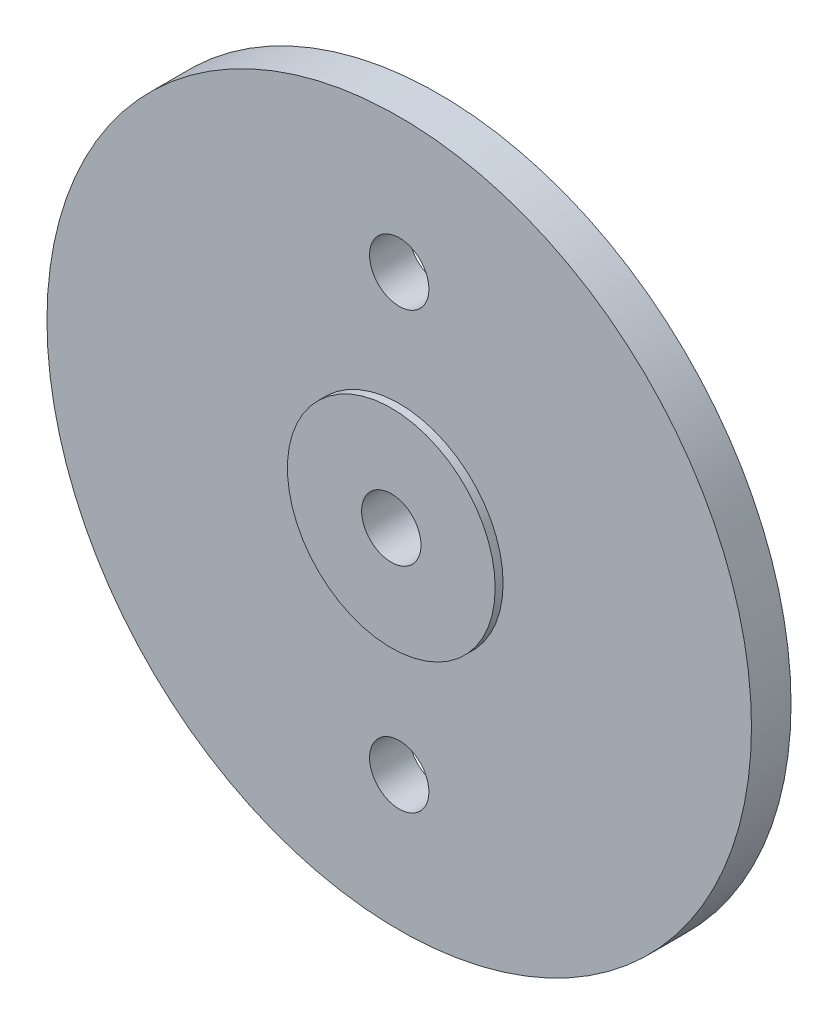
ISO-10303-21;
HEADER;
FILE_DESCRIPTION(('STEP AP214'),'2;1');
FILE_NAME('part.step','',(''),(''),'','','');
FILE_SCHEMA(('AUTOMOTIVE_DESIGN { 1 0 10303 214 1 1 1 1 }'));
ENDSEC;
DATA;
#1=APPLICATION_CONTEXT('core data for automotive mechanical design processes');
#2=APPLICATION_PROTOCOL_DEFINITION('international standard','automotive_design',2000,#1);
#3=PRODUCT_CONTEXT('',#1,'mechanical');
#4=PRODUCT('Part','Part','',(#3));
#5=PRODUCT_RELATED_PRODUCT_CATEGORY('part','',(#4));
#6=PRODUCT_DEFINITION_FORMATION('','',#4);
#7=PRODUCT_DEFINITION_CONTEXT('part definition',#1,'design');
#8=PRODUCT_DEFINITION('design','',#6,#7);
#9=PRODUCT_DEFINITION_SHAPE('','',#8);
#10=(LENGTH_UNIT() NAMED_UNIT(*) SI_UNIT(.MILLI.,.METRE.));
#11=(NAMED_UNIT(*) PLANE_ANGLE_UNIT() SI_UNIT($,.RADIAN.));
#12=(NAMED_UNIT(*) SI_UNIT($,.STERADIAN.) SOLID_ANGLE_UNIT());
#13=UNCERTAINTY_MEASURE_WITH_UNIT(LENGTH_MEASURE(1.E-05),#10,'distance_accuracy_value','');
#14=(GEOMETRIC_REPRESENTATION_CONTEXT(3) GLOBAL_UNCERTAINTY_ASSIGNED_CONTEXT((#13)) GLOBAL_UNIT_ASSIGNED_CONTEXT((#10,
#11,#12)) REPRESENTATION_CONTEXT('',''));
#15=CARTESIAN_POINT('',(0.,0.,0.));
#16=DIRECTION('',(0.,0.,1.));
#17=DIRECTION('',(1.,0.,0.));
#18=AXIS2_PLACEMENT_3D('',#15,#16,#17);
#19=CARTESIAN_POINT('',(0.,0.,2.));
#20=DIRECTION('',(0.,0.,-1.));
#21=DIRECTION('',(-1.,0.,0.));
#22=AXIS2_PLACEMENT_3D('',#19,#20,#21);
#23=CYLINDRICAL_SURFACE('',#22,17.8);
#24=CARTESIAN_POINT('',(0.,0.,2.));
#25=DIRECTION('',(0.,0.,1.));
#26=DIRECTION('',(1.,0.,0.));
#27=AXIS2_PLACEMENT_3D('',#24,#25,#26);
#28=CIRCLE('',#27,17.8);
#29=CARTESIAN_POINT('',(17.8,0.,2.));
#30=VERTEX_POINT('',#29);
#31=EDGE_CURVE('E57',#30,#30,#28,.T.);
#32=ORIENTED_EDGE('',*,*,#31,.F.);
#33=EDGE_LOOP('',(#32));
#34=FACE_BOUND('',#33,.T.);
#35=CARTESIAN_POINT('',(0.,0.,0.));
#36=DIRECTION('',(0.,0.,1.));
#37=DIRECTION('',(1.,0.,0.));
#38=AXIS2_PLACEMENT_3D('',#35,#36,#37);
#39=CIRCLE('',#38,17.8);
#40=CARTESIAN_POINT('',(17.8,0.,0.));
#41=VERTEX_POINT('',#40);
#42=EDGE_CURVE('E56',#41,#41,#39,.T.);
#43=ORIENTED_EDGE('',*,*,#42,.T.);
#44=EDGE_LOOP('',(#43));
#45=FACE_BOUND('',#44,.T.);
#46=ADVANCED_FACE('F31',(#34,#45),#23,.T.);
#47=CARTESIAN_POINT('',(0.,0.,2.));
#48=DIRECTION('',(0.,0.,1.));
#49=DIRECTION('',(1.,0.,0.));
#50=AXIS2_PLACEMENT_3D('',#47,#48,#49);
#51=PLANE('',#50);
#52=CARTESIAN_POINT('',(0.,11.,2.));
#53=DIRECTION('',(0.,0.,1.));
#54=DIRECTION('',(1.,0.,0.));
#55=AXIS2_PLACEMENT_3D('',#52,#53,#54);
#56=CIRCLE('',#55,1.5);
#57=CARTESIAN_POINT('',(1.5,11.,2.));
#58=VERTEX_POINT('',#57);
#59=EDGE_CURVE('E65',#58,#58,#56,.T.);
#60=ORIENTED_EDGE('',*,*,#59,.F.);
#61=EDGE_LOOP('',(#60));
#62=FACE_BOUND('',#61,.T.);
#63=CARTESIAN_POINT('',(0.,-11.,2.));
#64=DIRECTION('',(0.,0.,1.));
#65=DIRECTION('',(1.,0.,0.));
#66=AXIS2_PLACEMENT_3D('',#63,#64,#65);
#67=CIRCLE('',#66,1.5);
#68=CARTESIAN_POINT('',(1.5,-11.,2.));
#69=VERTEX_POINT('',#68);
#70=EDGE_CURVE('E71',#69,#69,#67,.T.);
#71=ORIENTED_EDGE('',*,*,#70,.F.);
#72=EDGE_LOOP('',(#71));
#73=FACE_BOUND('',#72,.T.);
#74=CARTESIAN_POINT('',(0.,0.,2.));
#75=DIRECTION('',(0.,0.,1.));
#76=DIRECTION('',(1.,0.,0.));
#77=AXIS2_PLACEMENT_3D('',#74,#75,#76);
#78=CIRCLE('',#77,5.25);
#79=CARTESIAN_POINT('',(5.25,0.,2.));
#80=VERTEX_POINT('',#79);
#81=EDGE_CURVE('E10',#80,#80,#78,.T.);
#82=ORIENTED_EDGE('',*,*,#81,.F.);
#83=EDGE_LOOP('',(#82));
#84=FACE_BOUND('',#83,.T.);
#85=ORIENTED_EDGE('',*,*,#31,.T.);
#86=EDGE_LOOP('',(#85));
#87=FACE_BOUND('',#86,.T.);
#88=ADVANCED_FACE('F103',(#62,#73,#84,#87),#51,.T.);
#89=CARTESIAN_POINT('',(0.,0.,0.));
#90=DIRECTION('',(0.,0.,1.));
#91=DIRECTION('',(1.,0.,0.));
#92=AXIS2_PLACEMENT_3D('',#89,#90,#91);
#93=PLANE('',#92);
#94=CARTESIAN_POINT('',(0.,11.,0.));
#95=DIRECTION('',(0.,0.,1.));
#96=DIRECTION('',(1.,0.,0.));
#97=AXIS2_PLACEMENT_3D('',#94,#95,#96);
#98=CIRCLE('',#97,1.5);
#99=CARTESIAN_POINT('',(1.5,11.,0.));
#100=VERTEX_POINT('',#99);
#101=EDGE_CURVE('E35',#100,#100,#98,.T.);
#102=ORIENTED_EDGE('',*,*,#101,.T.);
#103=EDGE_LOOP('',(#102));
#104=FACE_BOUND('',#103,.T.);
#105=CARTESIAN_POINT('',(0.,-11.,0.));
#106=DIRECTION('',(0.,0.,1.));
#107=DIRECTION('',(1.,0.,0.));
#108=AXIS2_PLACEMENT_3D('',#105,#106,#107);
#109=CIRCLE('',#108,1.5);
#110=CARTESIAN_POINT('',(1.5,-11.,0.));
#111=VERTEX_POINT('',#110);
#112=EDGE_CURVE('E63',#111,#111,#109,.T.);
#113=ORIENTED_EDGE('',*,*,#112,.T.);
#114=EDGE_LOOP('',(#113));
#115=FACE_BOUND('',#114,.T.);
#116=CARTESIAN_POINT('',(0.,0.,0.));
#117=DIRECTION('',(0.,0.,1.));
#118=DIRECTION('',(1.,0.,0.));
#119=AXIS2_PLACEMENT_3D('',#116,#117,#118);
#120=CIRCLE('',#119,7.86396405194257);
#121=CARTESIAN_POINT('',(7.86396405194257,0.,0.));
#122=VERTEX_POINT('',#121);
#123=EDGE_CURVE('E44',#122,#122,#120,.F.);
#124=ORIENTED_EDGE('',*,*,#123,.F.);
#125=EDGE_LOOP('',(#124));
#126=FACE_BOUND('',#125,.T.);
#127=ORIENTED_EDGE('',*,*,#42,.F.);
#128=EDGE_LOOP('',(#127));
#129=FACE_BOUND('',#128,.T.);
#130=ADVANCED_FACE('F108',(#104,#115,#126,#129),#93,.F.);
#131=CARTESIAN_POINT('',(0.,0.,-0.8));
#132=DIRECTION('',(0.,0.,1.));
#133=DIRECTION('',(-1.,0.,0.));
#134=AXIS2_PLACEMENT_3D('',#131,#132,#133);
#135=CONICAL_SURFACE('',#134,7.85,0.0174532925199433);
#136=CARTESIAN_POINT('',(0.,0.,-0.8));
#137=DIRECTION('',(0.,0.,-1.));
#138=DIRECTION('',(-1.,0.,0.));
#139=AXIS2_PLACEMENT_3D('',#136,#137,#138);
#140=CIRCLE('',#139,7.85);
#141=CARTESIAN_POINT('',(-7.85,0.,-0.8));
#142=VERTEX_POINT('',#141);
#143=EDGE_CURVE('E52',#142,#142,#140,.T.);
#144=ORIENTED_EDGE('',*,*,#143,.F.);
#145=EDGE_LOOP('',(#144));
#146=FACE_BOUND('',#145,.T.);
#147=ORIENTED_EDGE('',*,*,#123,.T.);
#148=EDGE_LOOP('',(#147));
#149=FACE_BOUND('',#148,.T.);
#150=ADVANCED_FACE('F33',(#146,#149),#135,.T.);
#151=CARTESIAN_POINT('',(0.,0.,-0.8));
#152=DIRECTION('',(0.,0.,-1.));
#153=DIRECTION('',(-1.,0.,0.));
#154=AXIS2_PLACEMENT_3D('',#151,#152,#153);
#155=PLANE('',#154);
#156=CARTESIAN_POINT('',(0.,0.,-0.8));
#157=DIRECTION('',(0.,0.,-1.));
#158=DIRECTION('',(-1.,0.,0.));
#159=AXIS2_PLACEMENT_3D('',#156,#157,#158);
#160=CIRCLE('',#159,4.8);
#161=CARTESIAN_POINT('',(-4.8,0.,-0.8));
#162=VERTEX_POINT('',#161);
#163=EDGE_CURVE('E39',#162,#162,#160,.T.);
#164=ORIENTED_EDGE('',*,*,#163,.F.);
#165=EDGE_LOOP('',(#164));
#166=FACE_BOUND('',#165,.T.);
#167=ORIENTED_EDGE('',*,*,#143,.T.);
#168=EDGE_LOOP('',(#167));
#169=FACE_BOUND('',#168,.T.);
#170=ADVANCED_FACE('F117',(#166,#169),#155,.T.);
#171=CARTESIAN_POINT('',(0.,0.,-2.7));
#172=DIRECTION('',(0.,0.,1.));
#173=DIRECTION('',(1.,0.,0.));
#174=AXIS2_PLACEMENT_3D('',#171,#172,#173);
#175=CYLINDRICAL_SURFACE('',#174,4.8);
#176=CARTESIAN_POINT('',(0.,0.,-2.7));
#177=DIRECTION('',(0.,0.,-1.));
#178=DIRECTION('',(-1.,0.,0.));
#179=AXIS2_PLACEMENT_3D('',#176,#177,#178);
#180=CIRCLE('',#179,4.8);
#181=CARTESIAN_POINT('',(-4.8,0.,-2.7));
#182=VERTEX_POINT('',#181);
#183=EDGE_CURVE('E50',#182,#182,#180,.T.);
#184=ORIENTED_EDGE('',*,*,#183,.F.);
#185=EDGE_LOOP('',(#184));
#186=FACE_BOUND('',#185,.T.);
#187=ORIENTED_EDGE('',*,*,#163,.T.);
#188=EDGE_LOOP('',(#187));
#189=FACE_BOUND('',#188,.T.);
#190=ADVANCED_FACE('F99',(#186,#189),#175,.T.);
#191=CARTESIAN_POINT('',(0.,0.,-2.7));
#192=DIRECTION('',(0.,0.,-1.));
#193=DIRECTION('',(-1.,0.,0.));
#194=AXIS2_PLACEMENT_3D('',#191,#192,#193);
#195=PLANE('',#194);
#196=CARTESIAN_POINT('',(0.,0.,-2.7));
#197=DIRECTION('',(0.,0.,-1.));
#198=DIRECTION('',(-1.,0.,0.));
#199=AXIS2_PLACEMENT_3D('',#196,#197,#198);
#200=CIRCLE('',#199,1.5);
#201=CARTESIAN_POINT('',(-1.5,0.,-2.7));
#202=VERTEX_POINT('',#201);
#203=EDGE_CURVE('E79',#202,#202,#200,.T.);
#204=ORIENTED_EDGE('',*,*,#203,.F.);
#205=EDGE_LOOP('',(#204));
#206=FACE_BOUND('',#205,.T.);
#207=ORIENTED_EDGE('',*,*,#183,.T.);
#208=EDGE_LOOP('',(#207));
#209=FACE_BOUND('',#208,.T.);
#210=ADVANCED_FACE('F90',(#206,#209),#195,.T.);
#211=CARTESIAN_POINT('',(0.,0.,2.4));
#212=DIRECTION('',(0.,0.,-1.));
#213=DIRECTION('',(-1.,0.,0.));
#214=AXIS2_PLACEMENT_3D('',#211,#212,#213);
#215=CYLINDRICAL_SURFACE('',#214,5.25);
#216=CARTESIAN_POINT('',(0.,0.,2.4));
#217=DIRECTION('',(0.,0.,1.));
#218=DIRECTION('',(1.,0.,0.));
#219=AXIS2_PLACEMENT_3D('',#216,#217,#218);
#220=CIRCLE('',#219,5.25);
#221=CARTESIAN_POINT('',(5.25,0.,2.4));
#222=VERTEX_POINT('',#221);
#223=EDGE_CURVE('E48',#222,#222,#220,.T.);
#224=ORIENTED_EDGE('',*,*,#223,.F.);
#225=EDGE_LOOP('',(#224));
#226=FACE_BOUND('',#225,.T.);
#227=ORIENTED_EDGE('',*,*,#81,.T.);
#228=EDGE_LOOP('',(#227));
#229=FACE_BOUND('',#228,.T.);
#230=ADVANCED_FACE('F88',(#226,#229),#215,.T.);
#231=CARTESIAN_POINT('',(0.,0.,2.4));
#232=DIRECTION('',(0.,0.,1.));
#233=DIRECTION('',(1.,0.,0.));
#234=AXIS2_PLACEMENT_3D('',#231,#232,#233);
#235=PLANE('',#234);
#236=CARTESIAN_POINT('',(0.,0.,2.4));
#237=DIRECTION('',(0.,0.,1.));
#238=DIRECTION('',(1.,0.,0.));
#239=AXIS2_PLACEMENT_3D('',#236,#237,#238);
#240=CIRCLE('',#239,1.5);
#241=CARTESIAN_POINT('',(1.5,0.,2.4));
#242=VERTEX_POINT('',#241);
#243=EDGE_CURVE('E69',#242,#242,#240,.T.);
#244=ORIENTED_EDGE('',*,*,#243,.F.);
#245=EDGE_LOOP('',(#244));
#246=FACE_BOUND('',#245,.T.);
#247=ORIENTED_EDGE('',*,*,#223,.T.);
#248=EDGE_LOOP('',(#247));
#249=FACE_BOUND('',#248,.T.);
#250=ADVANCED_FACE('F86',(#246,#249),#235,.T.);
#251=CARTESIAN_POINT('',(0.,0.,-8.));
#252=DIRECTION('',(0.,0.,1.));
#253=DIRECTION('',(1.,0.,0.));
#254=AXIS2_PLACEMENT_3D('',#251,#252,#253);
#255=CYLINDRICAL_SURFACE('',#254,1.5);
#256=ORIENTED_EDGE('',*,*,#203,.T.);
#257=EDGE_LOOP('',(#256));
#258=FACE_BOUND('',#257,.T.);
#259=ORIENTED_EDGE('',*,*,#243,.T.);
#260=EDGE_LOOP('',(#259));
#261=FACE_BOUND('',#260,.T.);
#262=ADVANCED_FACE('F96',(#258,#261),#255,.F.);
#263=CARTESIAN_POINT('',(0.,-11.,-8.));
#264=DIRECTION('',(0.,0.,1.));
#265=DIRECTION('',(1.,0.,0.));
#266=AXIS2_PLACEMENT_3D('',#263,#264,#265);
#267=CYLINDRICAL_SURFACE('',#266,1.5);
#268=ORIENTED_EDGE('',*,*,#70,.T.);
#269=EDGE_LOOP('',(#268));
#270=FACE_BOUND('',#269,.T.);
#271=ORIENTED_EDGE('',*,*,#112,.F.);
#272=EDGE_LOOP('',(#271));
#273=FACE_BOUND('',#272,.T.);
#274=ADVANCED_FACE('F174',(#270,#273),#267,.F.);
#275=CARTESIAN_POINT('',(0.,11.,-8.));
#276=DIRECTION('',(0.,0.,1.));
#277=DIRECTION('',(1.,0.,0.));
#278=AXIS2_PLACEMENT_3D('',#275,#276,#277);
#279=CYLINDRICAL_SURFACE('',#278,1.5);
#280=ORIENTED_EDGE('',*,*,#59,.T.);
#281=EDGE_LOOP('',(#280));
#282=FACE_BOUND('',#281,.T.);
#283=ORIENTED_EDGE('',*,*,#101,.F.);
#284=EDGE_LOOP('',(#283));
#285=FACE_BOUND('',#284,.T.);
#286=ADVANCED_FACE('F194',(#282,#285),#279,.F.);
#287=CLOSED_SHELL('',(#46,#88,#130,#150,#170,#190,#210,#230,#250,#262,#274,#286));
#288=MANIFOLD_SOLID_BREP('B2',#287);
#289=ADVANCED_BREP_SHAPE_REPRESENTATION('',(#18,#288),#14);
#290=SHAPE_DEFINITION_REPRESENTATION(#9,#289);
ENDSEC;
END-ISO-10303-21;
